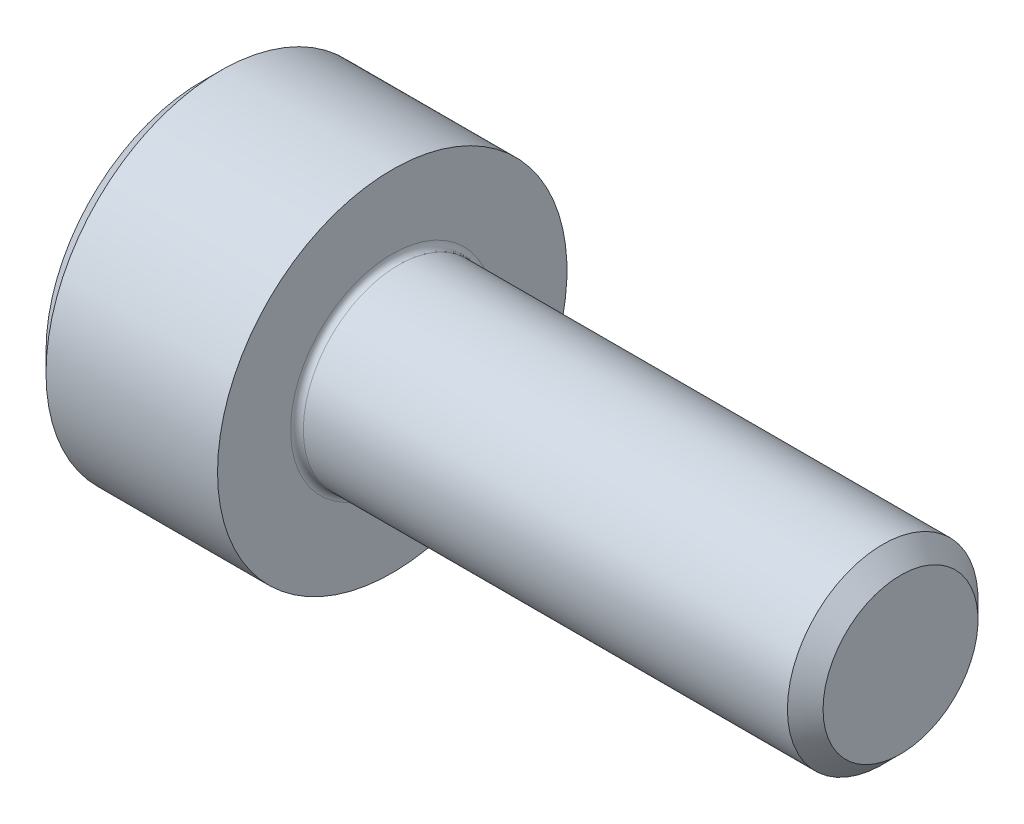
ISO-10303-21;
HEADER;
FILE_DESCRIPTION(('STEP AP214'),'2;1');
FILE_NAME('part.step','',(''),(''),'','','');
FILE_SCHEMA(('AUTOMOTIVE_DESIGN { 1 0 10303 214 1 1 1 1 }'));
ENDSEC;
DATA;
#1=APPLICATION_CONTEXT('core data for automotive mechanical design processes');
#2=APPLICATION_PROTOCOL_DEFINITION('international standard','automotive_design',2000,#1);
#3=PRODUCT_CONTEXT('',#1,'mechanical');
#4=PRODUCT('Part','Part','',(#3));
#5=PRODUCT_RELATED_PRODUCT_CATEGORY('part','',(#4));
#6=PRODUCT_DEFINITION_FORMATION('','',#4);
#7=PRODUCT_DEFINITION_CONTEXT('part definition',#1,'design');
#8=PRODUCT_DEFINITION('design','',#6,#7);
#9=PRODUCT_DEFINITION_SHAPE('','',#8);
#10=(LENGTH_UNIT() NAMED_UNIT(*) SI_UNIT(.MILLI.,.METRE.));
#11=(NAMED_UNIT(*) PLANE_ANGLE_UNIT() SI_UNIT($,.RADIAN.));
#12=(NAMED_UNIT(*) SI_UNIT($,.STERADIAN.) SOLID_ANGLE_UNIT());
#13=UNCERTAINTY_MEASURE_WITH_UNIT(LENGTH_MEASURE(1.E-05),#10,'distance_accuracy_value','');
#14=(GEOMETRIC_REPRESENTATION_CONTEXT(3) GLOBAL_UNCERTAINTY_ASSIGNED_CONTEXT((#13)) GLOBAL_UNIT_ASSIGNED_CONTEXT((#10,
#11,#12)) REPRESENTATION_CONTEXT('',''));
#15=CARTESIAN_POINT('',(0.,0.,0.));
#16=DIRECTION('',(0.,0.,1.));
#17=DIRECTION('',(1.,0.,0.));
#18=AXIS2_PLACEMENT_3D('',#15,#16,#17);
#19=CARTESIAN_POINT('',(0.,0.,0.));
#20=DIRECTION('',(-1.,0.,0.));
#21=DIRECTION('',(0.,0.,1.));
#22=AXIS2_PLACEMENT_3D('',#19,#20,#21);
#23=PLANE('',#22);
#24=DIRECTION('',(0.,-0.5,0.866025403784439));
#25=VECTOR('',#24,1.);
#26=CARTESIAN_POINT('',(0.,1.47801668912544,0.));
#27=LINE('',#26,#25);
#28=CARTESIAN_POINT('',(0.,1.47801668912544,0.));
#29=VERTEX_POINT('',#28);
#30=CARTESIAN_POINT('',(0.,0.739008344562719,1.28));
#31=VERTEX_POINT('',#30);
#32=EDGE_CURVE('E260',#29,#31,#27,.T.);
#33=ORIENTED_EDGE('',*,*,#32,.T.);
#34=DIRECTION('',(0.,1.,0.));
#35=VECTOR('',#34,1.);
#36=CARTESIAN_POINT('',(0.,-0.739008344562723,1.28));
#37=LINE('',#36,#35);
#38=CARTESIAN_POINT('',(0.,-0.739008344562723,1.28));
#39=VERTEX_POINT('',#38);
#40=EDGE_CURVE('E131',#39,#31,#37,.T.);
#41=ORIENTED_EDGE('',*,*,#40,.F.);
#42=DIRECTION('',(0.,-0.500000000000001,-0.866025403784438));
#43=VECTOR('',#42,1.);
#44=CARTESIAN_POINT('',(0.,-0.739008344562723,1.28));
#45=LINE('',#44,#43);
#46=CARTESIAN_POINT('',(0.,-1.47801668912545,0.));
#47=VERTEX_POINT('',#46);
#48=EDGE_CURVE('E263',#39,#47,#45,.T.);
#49=ORIENTED_EDGE('',*,*,#48,.T.);
#50=DIRECTION('',(0.,0.5,-0.866025403784439));
#51=VECTOR('',#50,1.);
#52=CARTESIAN_POINT('',(0.,-1.47801668912545,0.));
#53=LINE('',#52,#51);
#54=CARTESIAN_POINT('',(0.,-0.739008344562725,-1.28));
#55=VERTEX_POINT('',#54);
#56=EDGE_CURVE('E266',#47,#55,#53,.T.);
#57=ORIENTED_EDGE('',*,*,#56,.T.);
#58=DIRECTION('',(0.,-1.,0.));
#59=VECTOR('',#58,1.);
#60=CARTESIAN_POINT('',(0.,0.739008344562717,-1.28));
#61=LINE('',#60,#59);
#62=CARTESIAN_POINT('',(0.,0.739008344562717,-1.28));
#63=VERTEX_POINT('',#62);
#64=EDGE_CURVE('E269',#63,#55,#61,.T.);
#65=ORIENTED_EDGE('',*,*,#64,.F.);
#66=DIRECTION('',(0.,-0.500000000000001,-0.866025403784438));
#67=VECTOR('',#66,1.);
#68=CARTESIAN_POINT('',(0.,1.47801668912544,0.));
#69=LINE('',#68,#67);
#70=EDGE_CURVE('E126',#29,#63,#69,.T.);
#71=ORIENTED_EDGE('',*,*,#70,.F.);
#72=EDGE_LOOP('',(#33,#41,#49,#57,#65,#71));
#73=FACE_BOUND('',#72,.T.);
#74=CARTESIAN_POINT('',(0.,0.,0.));
#75=DIRECTION('',(-1.,0.,0.));
#76=DIRECTION('',(0.,0.,1.));
#77=AXIS2_PLACEMENT_3D('',#74,#75,#76);
#78=CIRCLE('',#77,2.45);
#79=CARTESIAN_POINT('',(0.,0.,2.45));
#80=VERTEX_POINT('',#79);
#81=EDGE_CURVE('E155',#80,#80,#78,.T.);
#82=ORIENTED_EDGE('',*,*,#81,.T.);
#83=EDGE_LOOP('',(#82));
#84=FACE_BOUND('',#83,.T.);
#85=ADVANCED_FACE('F35',(#73,#84),#23,.T.);
#86=CARTESIAN_POINT('',(0.,0.,0.));
#87=DIRECTION('',(1.,0.,0.));
#88=DIRECTION('',(0.,0.,-1.));
#89=AXIS2_PLACEMENT_3D('',#86,#87,#88);
#90=CONICAL_SURFACE('',#89,2.45,0.785398163397447);
#91=CARTESIAN_POINT('',(0.300000000000002,0.,0.));
#92=DIRECTION('',(-1.,0.,0.));
#93=DIRECTION('',(0.,0.,1.));
#94=AXIS2_PLACEMENT_3D('',#91,#92,#93);
#95=CIRCLE('',#94,2.75);
#96=CARTESIAN_POINT('',(0.300000000000002,0.,2.75));
#97=VERTEX_POINT('',#96);
#98=EDGE_CURVE('E152',#97,#97,#95,.T.);
#99=ORIENTED_EDGE('',*,*,#98,.T.);
#100=EDGE_LOOP('',(#99));
#101=FACE_BOUND('',#100,.T.);
#102=ORIENTED_EDGE('',*,*,#81,.F.);
#103=EDGE_LOOP('',(#102));
#104=FACE_BOUND('',#103,.T.);
#105=ADVANCED_FACE('F176',(#101,#104),#90,.T.);
#106=CARTESIAN_POINT('',(-31.75,0.,0.));
#107=DIRECTION('',(-1.,0.,0.));
#108=DIRECTION('',(0.,0.,1.));
#109=AXIS2_PLACEMENT_3D('',#106,#107,#108);
#110=CYLINDRICAL_SURFACE('',#109,2.75);
#111=CARTESIAN_POINT('',(3.,0.,0.));
#112=DIRECTION('',(-1.,0.,0.));
#113=DIRECTION('',(0.,0.,1.));
#114=AXIS2_PLACEMENT_3D('',#111,#112,#113);
#115=CIRCLE('',#114,2.75);
#116=CARTESIAN_POINT('',(3.,0.,2.75));
#117=VERTEX_POINT('',#116);
#118=EDGE_CURVE('E149',#117,#117,#115,.T.);
#119=ORIENTED_EDGE('',*,*,#118,.T.);
#120=EDGE_LOOP('',(#119));
#121=FACE_BOUND('',#120,.T.);
#122=ORIENTED_EDGE('',*,*,#98,.F.);
#123=EDGE_LOOP('',(#122));
#124=FACE_BOUND('',#123,.T.);
#125=ADVANCED_FACE('F181',(#121,#124),#110,.T.);
#126=CARTESIAN_POINT('',(3.,2.75,0.));
#127=DIRECTION('',(1.,0.,0.));
#128=DIRECTION('',(0.,0.,-1.));
#129=AXIS2_PLACEMENT_3D('',#126,#127,#128);
#130=PLANE('',#129);
#131=CARTESIAN_POINT('',(3.,0.,0.));
#132=DIRECTION('',(1.,0.,0.));
#133=DIRECTION('',(0.,0.,-1.));
#134=AXIS2_PLACEMENT_3D('',#131,#132,#133);
#135=CIRCLE('',#134,1.59999999999998);
#136=CARTESIAN_POINT('',(3.,0.,-1.59999999999998));
#137=VERTEX_POINT('',#136);
#138=EDGE_CURVE('E43',#137,#137,#135,.F.);
#139=ORIENTED_EDGE('',*,*,#138,.T.);
#140=EDGE_LOOP('',(#139));
#141=FACE_BOUND('',#140,.T.);
#142=ORIENTED_EDGE('',*,*,#118,.F.);
#143=EDGE_LOOP('',(#142));
#144=FACE_BOUND('',#143,.T.);
#145=ADVANCED_FACE('F160',(#141,#144),#130,.T.);
#146=CARTESIAN_POINT('',(-31.75,0.,0.));
#147=DIRECTION('',(-1.,0.,0.));
#148=DIRECTION('',(0.,0.,1.));
#149=AXIS2_PLACEMENT_3D('',#146,#147,#148);
#150=CYLINDRICAL_SURFACE('',#149,1.49999999999998);
#151=CARTESIAN_POINT('',(3.1,0.,0.));
#152=DIRECTION('',(1.,0.,0.));
#153=DIRECTION('',(0.,0.,-1.));
#154=AXIS2_PLACEMENT_3D('',#151,#152,#153);
#155=CIRCLE('',#154,1.49999999999998);
#156=CARTESIAN_POINT('',(3.1,0.,-1.49999999999998));
#157=VERTEX_POINT('',#156);
#158=EDGE_CURVE('E11',#157,#157,#155,.T.);
#159=ORIENTED_EDGE('',*,*,#158,.T.);
#160=EDGE_LOOP('',(#159));
#161=FACE_BOUND('',#160,.T.);
#162=CARTESIAN_POINT('',(10.7195,0.,0.));
#163=DIRECTION('',(-1.,0.,0.));
#164=DIRECTION('',(0.,0.,1.));
#165=AXIS2_PLACEMENT_3D('',#162,#163,#164);
#166=CIRCLE('',#165,1.49999999999996);
#167=CARTESIAN_POINT('',(10.7195,0.,1.49999999999996));
#168=VERTEX_POINT('',#167);
#169=EDGE_CURVE('E146',#168,#168,#166,.T.);
#170=ORIENTED_EDGE('',*,*,#169,.T.);
#171=EDGE_LOOP('',(#170));
#172=FACE_BOUND('',#171,.T.);
#173=ADVANCED_FACE('F191',(#161,#172),#150,.T.);
#174=CARTESIAN_POINT('',(11.,0.,0.));
#175=DIRECTION('',(-1.,0.,0.));
#176=DIRECTION('',(0.,0.,1.));
#177=AXIS2_PLACEMENT_3D('',#174,#175,#176);
#178=CONICAL_SURFACE('',#177,1.2195,0.785398163397314);
#179=ORIENTED_EDGE('',*,*,#169,.F.);
#180=EDGE_LOOP('',(#179));
#181=FACE_BOUND('',#180,.T.);
#182=CARTESIAN_POINT('',(11.,0.,0.));
#183=DIRECTION('',(-1.,0.,0.));
#184=DIRECTION('',(0.,0.,1.));
#185=AXIS2_PLACEMENT_3D('',#182,#183,#184);
#186=CIRCLE('',#185,1.2195);
#187=CARTESIAN_POINT('',(11.,0.,1.2195));
#188=VERTEX_POINT('',#187);
#189=EDGE_CURVE('E142',#188,#188,#186,.T.);
#190=ORIENTED_EDGE('',*,*,#189,.T.);
#191=EDGE_LOOP('',(#190));
#192=FACE_BOUND('',#191,.T.);
#193=ADVANCED_FACE('F171',(#181,#192),#178,.T.);
#194=CARTESIAN_POINT('',(11.,1.2195,0.));
#195=DIRECTION('',(1.,0.,0.));
#196=DIRECTION('',(0.,0.,-1.));
#197=AXIS2_PLACEMENT_3D('',#194,#195,#196);
#198=PLANE('',#197);
#199=ORIENTED_EDGE('',*,*,#189,.F.);
#200=EDGE_LOOP('',(#199));
#201=FACE_BOUND('',#200,.T.);
#202=ADVANCED_FACE('F164',(#201),#198,.T.);
#203=CARTESIAN_POINT('',(3.1,0.,0.));
#204=DIRECTION('',(1.,0.,0.));
#205=DIRECTION('',(0.,0.,-1.));
#206=AXIS2_PLACEMENT_3D('',#203,#204,#205);
#207=TOROIDAL_SURFACE('',#206,1.59999999999998,0.1);
#208=ORIENTED_EDGE('',*,*,#158,.F.);
#209=EDGE_LOOP('',(#208));
#210=FACE_BOUND('',#209,.T.);
#211=ORIENTED_EDGE('',*,*,#138,.F.);
#212=EDGE_LOOP('',(#211));
#213=FACE_BOUND('',#212,.T.);
#214=ADVANCED_FACE('F37',(#210,#213),#207,.F.);
#215=CARTESIAN_POINT('',(1.3,1.47801668912544,0.));
#216=DIRECTION('',(0.,-0.866025403784439,-0.5));
#217=DIRECTION('',(0.,0.5,-0.866025403784439));
#218=AXIS2_PLACEMENT_3D('',#215,#216,#217);
#219=PLANE('',#218);
#220=ORIENTED_EDGE('',*,*,#32,.F.);
#221=DIRECTION('',(-1.,0.,0.));
#222=VECTOR('',#221,1.);
#223=CARTESIAN_POINT('',(1.3,1.47801668912544,0.));
#224=LINE('',#223,#222);
#225=CARTESIAN_POINT('',(1.3,1.47801668912544,0.));
#226=VERTEX_POINT('',#225);
#227=EDGE_CURVE('E250',#226,#29,#224,.T.);
#228=ORIENTED_EDGE('',*,*,#227,.F.);
#229=DIRECTION('',(0.,-0.5,0.866025403784439));
#230=VECTOR('',#229,1.);
#231=CARTESIAN_POINT('',(1.3,1.47801668912544,0.));
#232=LINE('',#231,#230);
#233=CARTESIAN_POINT('',(1.3,1.10851251684408,0.639999999999998));
#234=VERTEX_POINT('',#233);
#235=EDGE_CURVE('E118',#226,#234,#232,.T.);
#236=ORIENTED_EDGE('',*,*,#235,.T.);
#237=CARTESIAN_POINT('',(1.3,0.739008344562719,1.28));
#238=VERTEX_POINT('',#237);
#239=EDGE_CURVE('E109',#234,#238,#232,.T.);
#240=ORIENTED_EDGE('',*,*,#239,.T.);
#241=DIRECTION('',(-1.,0.,0.));
#242=VECTOR('',#241,1.);
#243=CARTESIAN_POINT('',(1.3,0.739008344562719,1.28));
#244=LINE('',#243,#242);
#245=EDGE_CURVE('E123',#238,#31,#244,.T.);
#246=ORIENTED_EDGE('',*,*,#245,.T.);
#247=EDGE_LOOP('',(#220,#228,#236,#240,#246));
#248=FACE_BOUND('',#247,.T.);
#249=ADVANCED_FACE('F122',(#248),#219,.T.);
#250=CARTESIAN_POINT('',(1.3,-0.739008344562723,1.28));
#251=DIRECTION('',(0.,0.,1.));
#252=DIRECTION('',(0.,-1.,0.));
#253=AXIS2_PLACEMENT_3D('',#250,#251,#252);
#254=PLANE('',#253);
#255=ORIENTED_EDGE('',*,*,#40,.T.);
#256=ORIENTED_EDGE('',*,*,#245,.F.);
#257=DIRECTION('',(0.,1.,0.));
#258=VECTOR('',#257,1.);
#259=CARTESIAN_POINT('',(1.3,-0.739008344562723,1.28));
#260=LINE('',#259,#258);
#261=CARTESIAN_POINT('',(1.3,0.,1.28));
#262=VERTEX_POINT('',#261);
#263=EDGE_CURVE('E106',#262,#238,#260,.T.);
#264=ORIENTED_EDGE('',*,*,#263,.F.);
#265=CARTESIAN_POINT('',(1.3,-0.739008344562723,1.28));
#266=VERTEX_POINT('',#265);
#267=EDGE_CURVE('E117',#266,#262,#260,.T.);
#268=ORIENTED_EDGE('',*,*,#267,.F.);
#269=DIRECTION('',(-1.,0.,0.));
#270=VECTOR('',#269,1.);
#271=CARTESIAN_POINT('',(1.3,-0.739008344562723,1.28));
#272=LINE('',#271,#270);
#273=EDGE_CURVE('E133',#266,#39,#272,.T.);
#274=ORIENTED_EDGE('',*,*,#273,.T.);
#275=EDGE_LOOP('',(#255,#256,#264,#268,#274));
#276=FACE_BOUND('',#275,.T.);
#277=ADVANCED_FACE('F128',(#276),#254,.F.);
#278=CARTESIAN_POINT('',(1.3,-0.739008344562723,1.28));
#279=DIRECTION('',(0.,0.866025403784438,-0.500000000000001));
#280=DIRECTION('',(0.,0.500000000000001,0.866025403784438));
#281=AXIS2_PLACEMENT_3D('',#278,#279,#280);
#282=PLANE('',#281);
#283=ORIENTED_EDGE('',*,*,#48,.F.);
#284=ORIENTED_EDGE('',*,*,#273,.F.);
#285=DIRECTION('',(0.,-0.500000000000001,-0.866025403784438));
#286=VECTOR('',#285,1.);
#287=CARTESIAN_POINT('',(1.3,-0.739008344562723,1.28));
#288=LINE('',#287,#286);
#289=CARTESIAN_POINT('',(1.3,-1.10851251684408,0.640000000000003));
#290=VERTEX_POINT('',#289);
#291=EDGE_CURVE('E289',#266,#290,#288,.T.);
#292=ORIENTED_EDGE('',*,*,#291,.T.);
#293=CARTESIAN_POINT('',(1.3,-1.47801668912545,0.));
#294=VERTEX_POINT('',#293);
#295=EDGE_CURVE('E278',#290,#294,#288,.T.);
#296=ORIENTED_EDGE('',*,*,#295,.T.);
#297=DIRECTION('',(-1.,0.,0.));
#298=VECTOR('',#297,1.);
#299=CARTESIAN_POINT('',(1.3,-1.47801668912545,0.));
#300=LINE('',#299,#298);
#301=EDGE_CURVE('E138',#294,#47,#300,.T.);
#302=ORIENTED_EDGE('',*,*,#301,.T.);
#303=EDGE_LOOP('',(#283,#284,#292,#296,#302));
#304=FACE_BOUND('',#303,.T.);
#305=ADVANCED_FACE('F204',(#304),#282,.T.);
#306=CARTESIAN_POINT('',(1.3,-1.47801668912545,0.));
#307=DIRECTION('',(0.,0.866025403784439,0.5));
#308=DIRECTION('',(0.,-0.5,0.866025403784439));
#309=AXIS2_PLACEMENT_3D('',#306,#307,#308);
#310=PLANE('',#309);
#311=ORIENTED_EDGE('',*,*,#56,.F.);
#312=ORIENTED_EDGE('',*,*,#301,.F.);
#313=DIRECTION('',(0.,0.5,-0.866025403784439));
#314=VECTOR('',#313,1.);
#315=CARTESIAN_POINT('',(1.3,-1.47801668912545,0.));
#316=LINE('',#315,#314);
#317=CARTESIAN_POINT('',(1.3,-1.10851251684409,-0.640000000000002));
#318=VERTEX_POINT('',#317);
#319=EDGE_CURVE('E256',#294,#318,#316,.T.);
#320=ORIENTED_EDGE('',*,*,#319,.T.);
#321=CARTESIAN_POINT('',(1.3,-0.739008344562725,-1.28));
#322=VERTEX_POINT('',#321);
#323=EDGE_CURVE('E288',#318,#322,#316,.T.);
#324=ORIENTED_EDGE('',*,*,#323,.T.);
#325=DIRECTION('',(-1.,0.,0.));
#326=VECTOR('',#325,1.);
#327=CARTESIAN_POINT('',(1.3,-0.739008344562725,-1.28));
#328=LINE('',#327,#326);
#329=EDGE_CURVE('E249',#322,#55,#328,.T.);
#330=ORIENTED_EDGE('',*,*,#329,.T.);
#331=EDGE_LOOP('',(#311,#312,#320,#324,#330));
#332=FACE_BOUND('',#331,.T.);
#333=ADVANCED_FACE('F207',(#332),#310,.T.);
#334=CARTESIAN_POINT('',(1.3,0.739008344562717,-1.28));
#335=DIRECTION('',(0.,0.,-1.));
#336=DIRECTION('',(0.,1.,0.));
#337=AXIS2_PLACEMENT_3D('',#334,#335,#336);
#338=PLANE('',#337);
#339=ORIENTED_EDGE('',*,*,#64,.T.);
#340=ORIENTED_EDGE('',*,*,#329,.F.);
#341=DIRECTION('',(0.,-1.,0.));
#342=VECTOR('',#341,1.);
#343=CARTESIAN_POINT('',(1.3,0.739008344562717,-1.28));
#344=LINE('',#343,#342);
#345=CARTESIAN_POINT('',(1.3,0.,-1.28));
#346=VERTEX_POINT('',#345);
#347=EDGE_CURVE('E253',#346,#322,#344,.T.);
#348=ORIENTED_EDGE('',*,*,#347,.F.);
#349=CARTESIAN_POINT('',(1.3,0.739008344562717,-1.28));
#350=VERTEX_POINT('',#349);
#351=EDGE_CURVE('E50',#350,#346,#344,.T.);
#352=ORIENTED_EDGE('',*,*,#351,.F.);
#353=DIRECTION('',(-1.,0.,0.));
#354=VECTOR('',#353,1.);
#355=CARTESIAN_POINT('',(1.3,0.739008344562717,-1.28));
#356=LINE('',#355,#354);
#357=EDGE_CURVE('E246',#350,#63,#356,.T.);
#358=ORIENTED_EDGE('',*,*,#357,.T.);
#359=EDGE_LOOP('',(#339,#340,#348,#352,#358));
#360=FACE_BOUND('',#359,.T.);
#361=ADVANCED_FACE('F211',(#360),#338,.F.);
#362=CARTESIAN_POINT('',(1.3,1.47801668912544,0.));
#363=DIRECTION('',(0.,0.866025403784438,-0.500000000000001));
#364=DIRECTION('',(0.,0.500000000000001,0.866025403784438));
#365=AXIS2_PLACEMENT_3D('',#362,#363,#364);
#366=PLANE('',#365);
#367=ORIENTED_EDGE('',*,*,#70,.T.);
#368=ORIENTED_EDGE('',*,*,#357,.F.);
#369=DIRECTION('',(0.,-0.500000000000001,-0.866025403784438));
#370=VECTOR('',#369,1.);
#371=CARTESIAN_POINT('',(1.3,1.47801668912544,0.));
#372=LINE('',#371,#370);
#373=CARTESIAN_POINT('',(1.3,1.10851251684408,-0.640000000000001));
#374=VERTEX_POINT('',#373);
#375=EDGE_CURVE('E236',#374,#350,#372,.T.);
#376=ORIENTED_EDGE('',*,*,#375,.F.);
#377=EDGE_CURVE('E242',#226,#374,#372,.T.);
#378=ORIENTED_EDGE('',*,*,#377,.F.);
#379=ORIENTED_EDGE('',*,*,#227,.T.);
#380=EDGE_LOOP('',(#367,#368,#376,#378,#379));
#381=FACE_BOUND('',#380,.T.);
#382=ADVANCED_FACE('F215',(#381),#366,.F.);
#383=CARTESIAN_POINT('',(1.3,1.47801668912544,0.));
#384=DIRECTION('',(1.,0.,0.));
#385=DIRECTION('',(0.,0.,-1.));
#386=AXIS2_PLACEMENT_3D('',#383,#384,#385);
#387=PLANE('',#386);
#388=ORIENTED_EDGE('',*,*,#347,.T.);
#389=ORIENTED_EDGE('',*,*,#323,.F.);
#390=CARTESIAN_POINT('',(1.3,0.,0.));
#391=DIRECTION('',(-1.,0.,0.));
#392=DIRECTION('',(0.,0.,1.));
#393=AXIS2_PLACEMENT_3D('',#390,#391,#392);
#394=CIRCLE('',#393,1.28);
#395=EDGE_CURVE('E284',#346,#318,#394,.T.);
#396=ORIENTED_EDGE('',*,*,#395,.F.);
#397=EDGE_LOOP('',(#388,#389,#396));
#398=FACE_BOUND('',#397,.T.);
#399=ADVANCED_FACE('F219',(#398),#387,.F.);
#400=ORIENTED_EDGE('',*,*,#319,.F.);
#401=ORIENTED_EDGE('',*,*,#295,.F.);
#402=EDGE_CURVE('E136',#318,#290,#394,.T.);
#403=ORIENTED_EDGE('',*,*,#402,.F.);
#404=EDGE_LOOP('',(#400,#401,#403));
#405=FACE_BOUND('',#404,.T.);
#406=ADVANCED_FACE('F222',(#405),#387,.F.);
#407=ORIENTED_EDGE('',*,*,#291,.F.);
#408=ORIENTED_EDGE('',*,*,#267,.T.);
#409=EDGE_CURVE('E132',#290,#262,#394,.T.);
#410=ORIENTED_EDGE('',*,*,#409,.F.);
#411=EDGE_LOOP('',(#407,#408,#410));
#412=FACE_BOUND('',#411,.T.);
#413=ADVANCED_FACE('F227',(#412),#387,.F.);
#414=ORIENTED_EDGE('',*,*,#263,.T.);
#415=ORIENTED_EDGE('',*,*,#239,.F.);
#416=EDGE_CURVE('E112',#262,#234,#394,.T.);
#417=ORIENTED_EDGE('',*,*,#416,.F.);
#418=EDGE_LOOP('',(#414,#415,#417));
#419=FACE_BOUND('',#418,.T.);
#420=ADVANCED_FACE('F108',(#419),#387,.F.);
#421=ORIENTED_EDGE('',*,*,#235,.F.);
#422=ORIENTED_EDGE('',*,*,#377,.T.);
#423=EDGE_CURVE('E143',#234,#374,#394,.T.);
#424=ORIENTED_EDGE('',*,*,#423,.F.);
#425=EDGE_LOOP('',(#421,#422,#424));
#426=FACE_BOUND('',#425,.T.);
#427=ADVANCED_FACE('F230',(#426),#387,.F.);
#428=ORIENTED_EDGE('',*,*,#375,.T.);
#429=ORIENTED_EDGE('',*,*,#351,.T.);
#430=EDGE_CURVE('E239',#374,#346,#394,.T.);
#431=ORIENTED_EDGE('',*,*,#430,.F.);
#432=EDGE_LOOP('',(#428,#429,#431));
#433=FACE_BOUND('',#432,.T.);
#434=ADVANCED_FACE('F200',(#433),#387,.F.);
#435=CARTESIAN_POINT('',(1.3,0.,0.));
#436=DIRECTION('',(-1.,0.,0.));
#437=DIRECTION('',(0.,0.,1.));
#438=AXIS2_PLACEMENT_3D('',#435,#436,#437);
#439=CONICAL_SURFACE('',#438,1.28,1.0471975511966);
#440=CARTESIAN_POINT('',(2.03900834456273,0.,0.));
#441=VERTEX_POINT('',#440);
#442=VERTEX_LOOP('',#441);
#443=FACE_BOUND('',#442,.T.);
#444=ORIENTED_EDGE('',*,*,#416,.T.);
#445=ORIENTED_EDGE('',*,*,#423,.T.);
#446=ORIENTED_EDGE('',*,*,#430,.T.);
#447=ORIENTED_EDGE('',*,*,#395,.T.);
#448=ORIENTED_EDGE('',*,*,#402,.T.);
#449=ORIENTED_EDGE('',*,*,#409,.T.);
#450=EDGE_LOOP('',(#444,#445,#446,#447,#448,#449));
#451=FACE_BOUND('',#450,.T.);
#452=ADVANCED_FACE('F198',(#443,#451),#439,.F.);
#453=CLOSED_SHELL('',(#85,#105,#125,#145,#173,#193,#202,#214,#249,#277,#305,#333,#361,#382,#399,
#406,#413,#420,#427,#434,#452));
#454=MANIFOLD_SOLID_BREP('B2',#453);
#455=ADVANCED_BREP_SHAPE_REPRESENTATION('',(#18,#454),#14);
#456=SHAPE_DEFINITION_REPRESENTATION(#9,#455);
ENDSEC;
END-ISO-10303-21;
